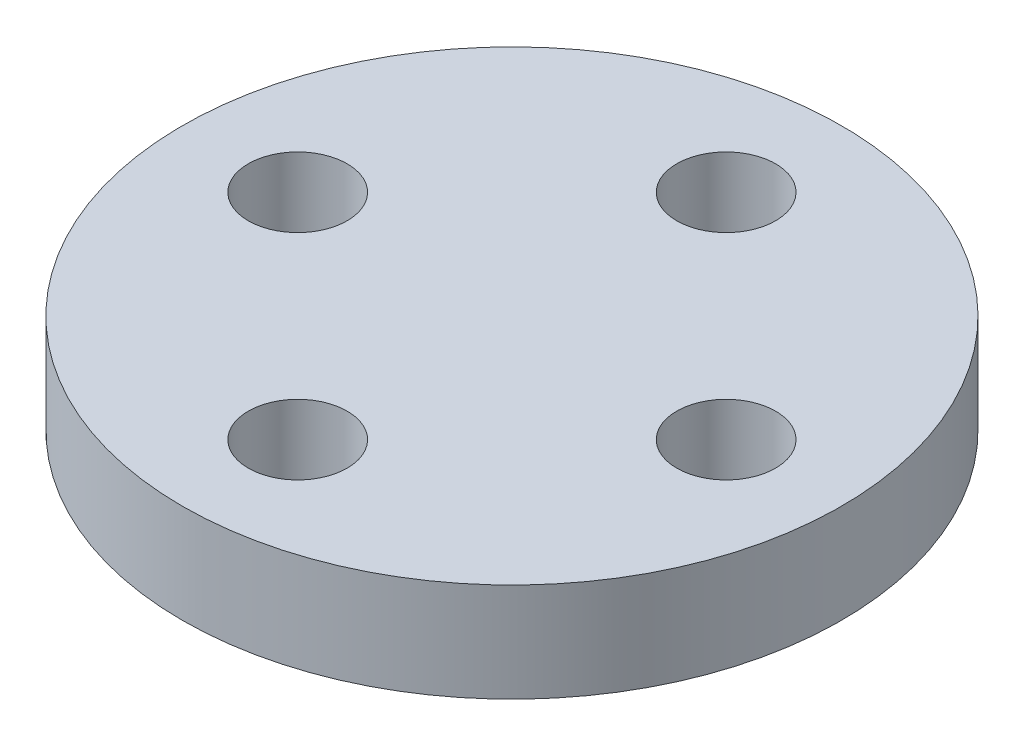
ISO-10303-21;
HEADER;
FILE_DESCRIPTION(('STEP AP214'),'2;1');
FILE_NAME('part.step','',(''),(''),'','','');
FILE_SCHEMA(('AUTOMOTIVE_DESIGN { 1 0 10303 214 1 1 1 1 }'));
ENDSEC;
DATA;
#1=APPLICATION_CONTEXT('core data for automotive mechanical design processes');
#2=APPLICATION_PROTOCOL_DEFINITION('international standard','automotive_design',2000,#1);
#3=PRODUCT_CONTEXT('',#1,'mechanical');
#4=PRODUCT('Part','Part','',(#3));
#5=PRODUCT_RELATED_PRODUCT_CATEGORY('part','',(#4));
#6=PRODUCT_DEFINITION_FORMATION('','',#4);
#7=PRODUCT_DEFINITION_CONTEXT('part definition',#1,'design');
#8=PRODUCT_DEFINITION('design','',#6,#7);
#9=PRODUCT_DEFINITION_SHAPE('','',#8);
#10=(LENGTH_UNIT() NAMED_UNIT(*) SI_UNIT(.MILLI.,.METRE.));
#11=(NAMED_UNIT(*) PLANE_ANGLE_UNIT() SI_UNIT($,.RADIAN.));
#12=(NAMED_UNIT(*) SI_UNIT($,.STERADIAN.) SOLID_ANGLE_UNIT());
#13=UNCERTAINTY_MEASURE_WITH_UNIT(LENGTH_MEASURE(1.E-05),#10,'distance_accuracy_value','');
#14=(GEOMETRIC_REPRESENTATION_CONTEXT(3) GLOBAL_UNCERTAINTY_ASSIGNED_CONTEXT((#13)) GLOBAL_UNIT_ASSIGNED_CONTEXT((#10,
#11,#12)) REPRESENTATION_CONTEXT('',''));
#15=CARTESIAN_POINT('',(0.,0.,0.));
#16=DIRECTION('',(0.,0.,1.));
#17=DIRECTION('',(1.,0.,0.));
#18=AXIS2_PLACEMENT_3D('',#15,#16,#17);
#19=CARTESIAN_POINT('',(0.,3.,0.));
#20=DIRECTION('',(0.,1.,0.));
#21=DIRECTION('',(0.,0.,1.));
#22=AXIS2_PLACEMENT_3D('',#19,#20,#21);
#23=PLANE('',#22);
#24=CARTESIAN_POINT('',(0.,3.,-6.5));
#25=DIRECTION('',(0.,1.,0.));
#26=DIRECTION('',(0.,0.,1.));
#27=AXIS2_PLACEMENT_3D('',#24,#25,#26);
#28=CIRCLE('',#27,1.5);
#29=CARTESIAN_POINT('',(0.,3.,-5.));
#30=VERTEX_POINT('',#29);
#31=EDGE_CURVE('E55',#30,#30,#28,.T.);
#32=ORIENTED_EDGE('',*,*,#31,.F.);
#33=EDGE_LOOP('',(#32));
#34=FACE_BOUND('',#33,.T.);
#35=CARTESIAN_POINT('',(0.,3.,6.5));
#36=DIRECTION('',(0.,1.,0.));
#37=DIRECTION('',(0.,0.,1.));
#38=AXIS2_PLACEMENT_3D('',#35,#36,#37);
#39=CIRCLE('',#38,1.5);
#40=CARTESIAN_POINT('',(0.,3.,8.));
#41=VERTEX_POINT('',#40);
#42=EDGE_CURVE('E67',#41,#41,#39,.T.);
#43=ORIENTED_EDGE('',*,*,#42,.F.);
#44=EDGE_LOOP('',(#43));
#45=FACE_BOUND('',#44,.T.);
#46=CARTESIAN_POINT('',(0.,3.,0.));
#47=DIRECTION('',(0.,1.,0.));
#48=DIRECTION('',(0.,0.,1.));
#49=AXIS2_PLACEMENT_3D('',#46,#47,#48);
#50=CIRCLE('',#49,10.);
#51=CARTESIAN_POINT('',(0.,3.,10.));
#52=VERTEX_POINT('',#51);
#53=EDGE_CURVE('E39',#52,#52,#50,.T.);
#54=ORIENTED_EDGE('',*,*,#53,.T.);
#55=EDGE_LOOP('',(#54));
#56=FACE_BOUND('',#55,.T.);
#57=CARTESIAN_POINT('',(-6.5,3.,0.));
#58=DIRECTION('',(0.,1.,0.));
#59=DIRECTION('',(0.,0.,1.));
#60=AXIS2_PLACEMENT_3D('',#57,#58,#59);
#61=CIRCLE('',#60,1.5);
#62=CARTESIAN_POINT('',(-6.5,3.,1.49999999999998));
#63=VERTEX_POINT('',#62);
#64=EDGE_CURVE('E61',#63,#63,#61,.T.);
#65=ORIENTED_EDGE('',*,*,#64,.F.);
#66=EDGE_LOOP('',(#65));
#67=FACE_BOUND('',#66,.T.);
#68=CARTESIAN_POINT('',(6.5,3.,0.));
#69=DIRECTION('',(0.,1.,0.));
#70=DIRECTION('',(0.,0.,1.));
#71=AXIS2_PLACEMENT_3D('',#68,#69,#70);
#72=CIRCLE('',#71,1.5);
#73=CARTESIAN_POINT('',(6.5,3.,1.50000000000007));
#74=VERTEX_POINT('',#73);
#75=EDGE_CURVE('E48',#74,#74,#72,.T.);
#76=ORIENTED_EDGE('',*,*,#75,.F.);
#77=EDGE_LOOP('',(#76));
#78=FACE_BOUND('',#77,.T.);
#79=ADVANCED_FACE('F31',(#34,#45,#56,#67,#78),#23,.T.);
#80=CARTESIAN_POINT('',(0.,0.,0.));
#81=DIRECTION('',(0.,1.,0.));
#82=DIRECTION('',(0.,0.,1.));
#83=AXIS2_PLACEMENT_3D('',#80,#81,#82);
#84=PLANE('',#83);
#85=CARTESIAN_POINT('',(0.,0.,0.));
#86=DIRECTION('',(0.,-1.,0.));
#87=DIRECTION('',(0.,0.,-1.));
#88=AXIS2_PLACEMENT_3D('',#85,#86,#87);
#89=CIRCLE('',#88,4.);
#90=CARTESIAN_POINT('',(0.,0.,-4.));
#91=VERTEX_POINT('',#90);
#92=EDGE_CURVE('E10',#91,#91,#89,.T.);
#93=ORIENTED_EDGE('',*,*,#92,.F.);
#94=EDGE_LOOP('',(#93));
#95=FACE_BOUND('',#94,.T.);
#96=CARTESIAN_POINT('',(0.,0.,0.));
#97=DIRECTION('',(0.,1.,0.));
#98=DIRECTION('',(0.,0.,1.));
#99=AXIS2_PLACEMENT_3D('',#96,#97,#98);
#100=CIRCLE('',#99,10.);
#101=CARTESIAN_POINT('',(0.,0.,10.));
#102=VERTEX_POINT('',#101);
#103=EDGE_CURVE('E35',#102,#102,#100,.T.);
#104=ORIENTED_EDGE('',*,*,#103,.F.);
#105=EDGE_LOOP('',(#104));
#106=FACE_BOUND('',#105,.T.);
#107=CARTESIAN_POINT('',(0.,0.,6.5));
#108=DIRECTION('',(0.,1.,0.));
#109=DIRECTION('',(0.,0.,1.));
#110=AXIS2_PLACEMENT_3D('',#107,#108,#109);
#111=CIRCLE('',#110,1.5);
#112=CARTESIAN_POINT('',(0.,0.,8.));
#113=VERTEX_POINT('',#112);
#114=EDGE_CURVE('E64',#113,#113,#111,.T.);
#115=ORIENTED_EDGE('',*,*,#114,.T.);
#116=EDGE_LOOP('',(#115));
#117=FACE_BOUND('',#116,.T.);
#118=CARTESIAN_POINT('',(-6.5,0.,0.));
#119=DIRECTION('',(0.,1.,0.));
#120=DIRECTION('',(0.,0.,1.));
#121=AXIS2_PLACEMENT_3D('',#118,#119,#120);
#122=CIRCLE('',#121,1.5);
#123=CARTESIAN_POINT('',(-6.5,0.,1.49999999999998));
#124=VERTEX_POINT('',#123);
#125=EDGE_CURVE('E58',#124,#124,#122,.T.);
#126=ORIENTED_EDGE('',*,*,#125,.T.);
#127=EDGE_LOOP('',(#126));
#128=FACE_BOUND('',#127,.T.);
#129=CARTESIAN_POINT('',(0.,0.,-6.5));
#130=DIRECTION('',(0.,1.,0.));
#131=DIRECTION('',(0.,0.,1.));
#132=AXIS2_PLACEMENT_3D('',#129,#130,#131);
#133=CIRCLE('',#132,1.5);
#134=CARTESIAN_POINT('',(0.,0.,-5.));
#135=VERTEX_POINT('',#134);
#136=EDGE_CURVE('E51',#135,#135,#133,.T.);
#137=ORIENTED_EDGE('',*,*,#136,.T.);
#138=EDGE_LOOP('',(#137));
#139=FACE_BOUND('',#138,.T.);
#140=CARTESIAN_POINT('',(6.5,0.,0.));
#141=DIRECTION('',(0.,1.,0.));
#142=DIRECTION('',(0.,0.,1.));
#143=AXIS2_PLACEMENT_3D('',#140,#141,#142);
#144=CIRCLE('',#143,1.5);
#145=CARTESIAN_POINT('',(6.5,0.,1.50000000000007));
#146=VERTEX_POINT('',#145);
#147=EDGE_CURVE('E52',#146,#146,#144,.T.);
#148=ORIENTED_EDGE('',*,*,#147,.T.);
#149=EDGE_LOOP('',(#148));
#150=FACE_BOUND('',#149,.T.);
#151=ADVANCED_FACE('F73',(#95,#106,#117,#128,#139,#150),#84,.F.);
#152=CARTESIAN_POINT('',(0.,3.,0.));
#153=DIRECTION('',(0.,-1.,0.));
#154=DIRECTION('',(0.,0.,-1.));
#155=AXIS2_PLACEMENT_3D('',#152,#153,#154);
#156=CYLINDRICAL_SURFACE('',#155,10.);
#157=ORIENTED_EDGE('',*,*,#53,.F.);
#158=EDGE_LOOP('',(#157));
#159=FACE_BOUND('',#158,.T.);
#160=ORIENTED_EDGE('',*,*,#103,.T.);
#161=EDGE_LOOP('',(#160));
#162=FACE_BOUND('',#161,.T.);
#163=ADVANCED_FACE('F33',(#159,#162),#156,.T.);
#164=CARTESIAN_POINT('',(0.,3.,6.5));
#165=DIRECTION('',(0.,-1.,0.));
#166=DIRECTION('',(0.,0.,-1.));
#167=AXIS2_PLACEMENT_3D('',#164,#165,#166);
#168=CYLINDRICAL_SURFACE('',#167,1.5);
#169=ORIENTED_EDGE('',*,*,#42,.T.);
#170=EDGE_LOOP('',(#169));
#171=FACE_BOUND('',#170,.T.);
#172=ORIENTED_EDGE('',*,*,#114,.F.);
#173=EDGE_LOOP('',(#172));
#174=FACE_BOUND('',#173,.T.);
#175=ADVANCED_FACE('F76',(#171,#174),#168,.F.);
#176=CARTESIAN_POINT('',(-6.5,3.,0.));
#177=DIRECTION('',(0.,-1.,0.));
#178=DIRECTION('',(0.,0.,-1.));
#179=AXIS2_PLACEMENT_3D('',#176,#177,#178);
#180=CYLINDRICAL_SURFACE('',#179,1.5);
#181=ORIENTED_EDGE('',*,*,#64,.T.);
#182=EDGE_LOOP('',(#181));
#183=FACE_BOUND('',#182,.T.);
#184=ORIENTED_EDGE('',*,*,#125,.F.);
#185=EDGE_LOOP('',(#184));
#186=FACE_BOUND('',#185,.T.);
#187=ADVANCED_FACE('F78',(#183,#186),#180,.F.);
#188=CARTESIAN_POINT('',(0.,3.,-6.5));
#189=DIRECTION('',(0.,-1.,0.));
#190=DIRECTION('',(0.,0.,-1.));
#191=AXIS2_PLACEMENT_3D('',#188,#189,#190);
#192=CYLINDRICAL_SURFACE('',#191,1.5);
#193=ORIENTED_EDGE('',*,*,#31,.T.);
#194=EDGE_LOOP('',(#193));
#195=FACE_BOUND('',#194,.T.);
#196=ORIENTED_EDGE('',*,*,#136,.F.);
#197=EDGE_LOOP('',(#196));
#198=FACE_BOUND('',#197,.T.);
#199=ADVANCED_FACE('F85',(#195,#198),#192,.F.);
#200=CARTESIAN_POINT('',(6.5,3.,0.));
#201=DIRECTION('',(0.,-1.,0.));
#202=DIRECTION('',(0.,0.,-1.));
#203=AXIS2_PLACEMENT_3D('',#200,#201,#202);
#204=CYLINDRICAL_SURFACE('',#203,1.5);
#205=ORIENTED_EDGE('',*,*,#75,.T.);
#206=EDGE_LOOP('',(#205));
#207=FACE_BOUND('',#206,.T.);
#208=ORIENTED_EDGE('',*,*,#147,.F.);
#209=EDGE_LOOP('',(#208));
#210=FACE_BOUND('',#209,.T.);
#211=ADVANCED_FACE('F106',(#207,#210),#204,.F.);
#212=CARTESIAN_POINT('',(0.,-3.,0.));
#213=DIRECTION('',(0.,1.,0.));
#214=DIRECTION('',(0.,0.,1.));
#215=AXIS2_PLACEMENT_3D('',#212,#213,#214);
#216=CYLINDRICAL_SURFACE('',#215,4.);
#217=CARTESIAN_POINT('',(0.,-3.,0.));
#218=DIRECTION('',(0.,-1.,0.));
#219=DIRECTION('',(0.,0.,-1.));
#220=AXIS2_PLACEMENT_3D('',#217,#218,#219);
#221=CIRCLE('',#220,4.);
#222=CARTESIAN_POINT('',(0.,-3.,-4.));
#223=VERTEX_POINT('',#222);
#224=EDGE_CURVE('E46',#223,#223,#221,.T.);
#225=ORIENTED_EDGE('',*,*,#224,.F.);
#226=EDGE_LOOP('',(#225));
#227=FACE_BOUND('',#226,.T.);
#228=ORIENTED_EDGE('',*,*,#92,.T.);
#229=EDGE_LOOP('',(#228));
#230=FACE_BOUND('',#229,.T.);
#231=ADVANCED_FACE('F109',(#227,#230),#216,.T.);
#232=CARTESIAN_POINT('',(0.,-3.,0.));
#233=DIRECTION('',(0.,-1.,0.));
#234=DIRECTION('',(0.,0.,-1.));
#235=AXIS2_PLACEMENT_3D('',#232,#233,#234);
#236=PLANE('',#235);
#237=CARTESIAN_POINT('',(0.,-3.,0.));
#238=DIRECTION('',(0.,-1.,0.));
#239=DIRECTION('',(0.,0.,-1.));
#240=AXIS2_PLACEMENT_3D('',#237,#238,#239);
#241=CIRCLE('',#240,1.5);
#242=CARTESIAN_POINT('',(0.,-3.,-1.5));
#243=VERTEX_POINT('',#242);
#244=EDGE_CURVE('E138',#243,#243,#241,.T.);
#245=ORIENTED_EDGE('',*,*,#244,.F.);
#246=EDGE_LOOP('',(#245));
#247=FACE_BOUND('',#246,.T.);
#248=ORIENTED_EDGE('',*,*,#224,.T.);
#249=EDGE_LOOP('',(#248));
#250=FACE_BOUND('',#249,.T.);
#251=ADVANCED_FACE('F117',(#247,#250),#236,.T.);
#252=CARTESIAN_POINT('',(0.,0.,0.));
#253=DIRECTION('',(0.,-1.,0.));
#254=DIRECTION('',(0.,0.,-1.));
#255=AXIS2_PLACEMENT_3D('',#252,#253,#254);
#256=CYLINDRICAL_SURFACE('',#255,1.5);
#257=CARTESIAN_POINT('',(0.,0.,0.));
#258=DIRECTION('',(0.,-1.,0.));
#259=DIRECTION('',(0.,0.,-1.));
#260=AXIS2_PLACEMENT_3D('',#257,#258,#259);
#261=CIRCLE('',#260,1.5);
#262=CARTESIAN_POINT('',(0.,0.,-1.5));
#263=VERTEX_POINT('',#262);
#264=EDGE_CURVE('E137',#263,#263,#261,.T.);
#265=ORIENTED_EDGE('',*,*,#264,.F.);
#266=EDGE_LOOP('',(#265));
#267=FACE_BOUND('',#266,.T.);
#268=ORIENTED_EDGE('',*,*,#244,.T.);
#269=EDGE_LOOP('',(#268));
#270=FACE_BOUND('',#269,.T.);
#271=ADVANCED_FACE('F125',(#267,#270),#256,.F.);
#272=CARTESIAN_POINT('',(0.,0.,0.));
#273=DIRECTION('',(0.,-1.,0.));
#274=DIRECTION('',(0.,0.,-1.));
#275=AXIS2_PLACEMENT_3D('',#272,#273,#274);
#276=PLANE('',#275);
#277=ORIENTED_EDGE('',*,*,#264,.T.);
#278=EDGE_LOOP('',(#277));
#279=FACE_BOUND('',#278,.T.);
#280=ADVANCED_FACE('F129',(#279),#276,.T.);
#281=CLOSED_SHELL('',(#79,#151,#163,#175,#187,#199,#211,#231,#251,#271,#280));
#282=MANIFOLD_SOLID_BREP('B2',#281);
#283=ADVANCED_BREP_SHAPE_REPRESENTATION('',(#18,#282),#14);
#284=SHAPE_DEFINITION_REPRESENTATION(#9,#283);
ENDSEC;
END-ISO-10303-21;
